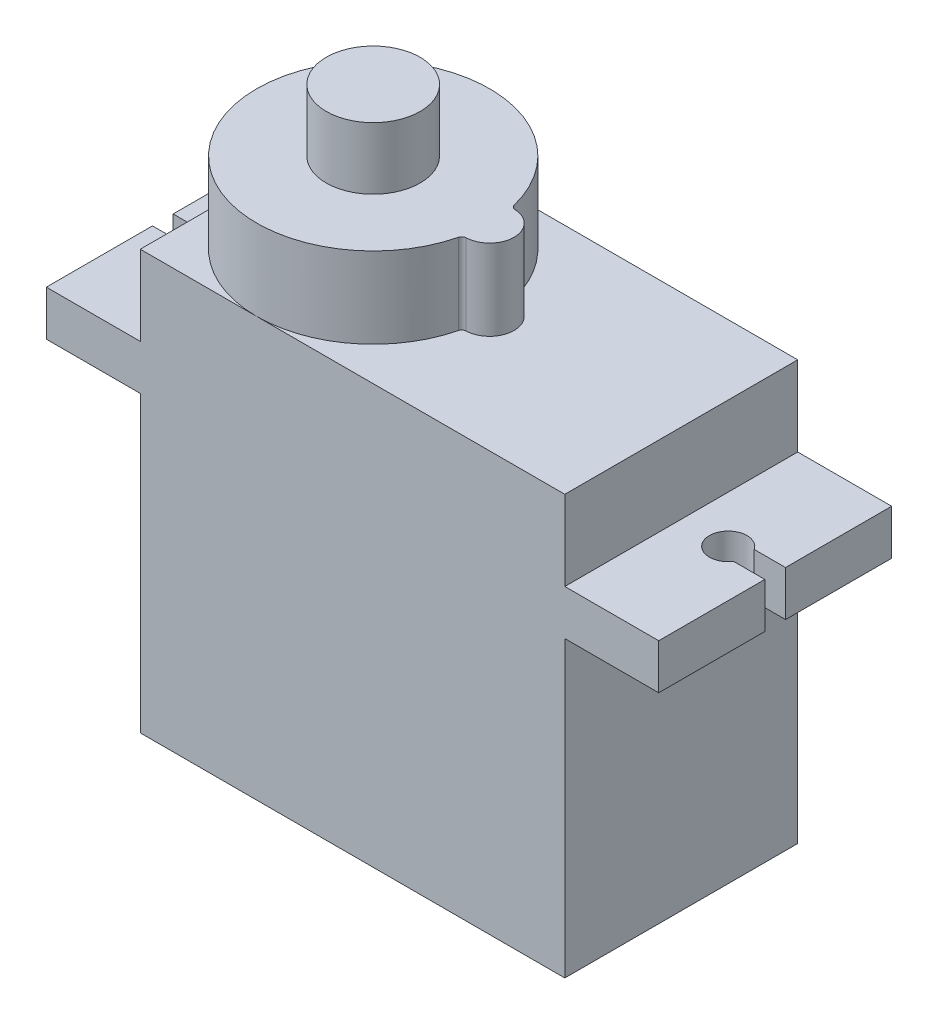
ISO-10303-21;
HEADER;
FILE_DESCRIPTION(('STEP AP214'),'2;1');
FILE_NAME('part.step','',(''),(''),'','','');
FILE_SCHEMA(('AUTOMOTIVE_DESIGN { 1 0 10303 214 1 1 1 1 }'));
ENDSEC;
DATA;
#1=APPLICATION_CONTEXT('core data for automotive mechanical design processes');
#2=APPLICATION_PROTOCOL_DEFINITION('international standard','automotive_design',2000,#1);
#3=PRODUCT_CONTEXT('',#1,'mechanical');
#4=PRODUCT('Part','Part','',(#3));
#5=PRODUCT_RELATED_PRODUCT_CATEGORY('part','',(#4));
#6=PRODUCT_DEFINITION_FORMATION('','',#4);
#7=PRODUCT_DEFINITION_CONTEXT('part definition',#1,'design');
#8=PRODUCT_DEFINITION('design','',#6,#7);
#9=PRODUCT_DEFINITION_SHAPE('','',#8);
#10=(LENGTH_UNIT() NAMED_UNIT(*) SI_UNIT(.MILLI.,.METRE.));
#11=(NAMED_UNIT(*) PLANE_ANGLE_UNIT() SI_UNIT($,.RADIAN.));
#12=(NAMED_UNIT(*) SI_UNIT($,.STERADIAN.) SOLID_ANGLE_UNIT());
#13=UNCERTAINTY_MEASURE_WITH_UNIT(LENGTH_MEASURE(1.E-05),#10,'distance_accuracy_value','');
#14=(GEOMETRIC_REPRESENTATION_CONTEXT(3) GLOBAL_UNCERTAINTY_ASSIGNED_CONTEXT((#13)) GLOBAL_UNIT_ASSIGNED_CONTEXT((#10,
#11,#12)) REPRESENTATION_CONTEXT('',''));
#15=CARTESIAN_POINT('',(0.,0.,0.));
#16=DIRECTION('',(0.,0.,1.));
#17=DIRECTION('',(1.,0.,0.));
#18=AXIS2_PLACEMENT_3D('',#15,#16,#17);
#19=CARTESIAN_POINT('',(-13600.,4499.23323880917,-1199.99975503217));
#20=DIRECTION('',(1.,0.,0.));
#21=DIRECTION('',(0.,0.,-1.));
#22=AXIS2_PLACEMENT_3D('',#19,#20,#21);
#23=CYLINDRICAL_SURFACE('',#22,600.);
#24=CARTESIAN_POINT('',(-13600.,4499.23323880917,-1199.99975503217));
#25=DIRECTION('',(-1.,0.,0.));
#26=DIRECTION('',(0.,0.,1.));
#27=AXIS2_PLACEMENT_3D('',#24,#25,#26);
#28=CIRCLE('',#27,600.);
#29=CARTESIAN_POINT('',(-13600.,4499.23323880917,-599.999755032172));
#30=VERTEX_POINT('',#29);
#31=EDGE_CURVE('E12',#30,#30,#28,.T.);
#32=ORIENTED_EDGE('',*,*,#31,.F.);
#33=EDGE_LOOP('',(#32));
#34=FACE_BOUND('',#33,.T.);
#35=CARTESIAN_POINT('',(-11300.,4499.23323880917,-1199.99975503217));
#36=DIRECTION('',(-1.,0.,0.));
#37=DIRECTION('',(0.,0.,1.));
#38=AXIS2_PLACEMENT_3D('',#35,#36,#37);
#39=CIRCLE('',#38,600.);
#40=CARTESIAN_POINT('',(-11300.,4499.23323880917,-599.999755032172));
#41=VERTEX_POINT('',#40);
#42=EDGE_CURVE('E63',#41,#41,#39,.T.);
#43=ORIENTED_EDGE('',*,*,#42,.T.);
#44=EDGE_LOOP('',(#43));
#45=FACE_BOUND('',#44,.T.);
#46=ADVANCED_FACE('F60',(#34,#45),#23,.T.);
#47=CARTESIAN_POINT('',(-13600.,0.,1.62193458052702E-12));
#48=DIRECTION('',(-1.,0.,0.));
#49=DIRECTION('',(0.,0.,1.));
#50=AXIS2_PLACEMENT_3D('',#47,#48,#49);
#51=PLANE('',#50);
#52=ORIENTED_EDGE('',*,*,#31,.T.);
#53=EDGE_LOOP('',(#52));
#54=FACE_BOUND('',#53,.T.);
#55=ADVANCED_FACE('F75',(#54),#51,.T.);
#56=CARTESIAN_POINT('',(-11300.,0.,1.29244903773504E-12));
#57=DIRECTION('',(-1.,0.,0.));
#58=DIRECTION('',(0.,0.,1.));
#59=AXIS2_PLACEMENT_3D('',#56,#57,#58);
#60=PLANE('',#59);
#61=ORIENTED_EDGE('',*,*,#42,.F.);
#62=EDGE_LOOP('',(#61));
#63=FACE_BOUND('',#62,.T.);
#64=ADVANCED_FACE('F73',(#63),#60,.F.);
#65=CLOSED_SHELL('',(#46,#55,#64));
#66=MANIFOLD_SOLID_BREP('B2',#65);
#67=CARTESIAN_POINT('',(-13600.,4500.,1.83417477069727E-12));
#68=DIRECTION('',(1.,0.,0.));
#69=DIRECTION('',(0.,0.,-1.));
#70=AXIS2_PLACEMENT_3D('',#67,#68,#69);
#71=CYLINDRICAL_SURFACE('',#70,600.);
#72=CARTESIAN_POINT('',(-13600.,4500.,1.83417477069727E-12));
#73=DIRECTION('',(-1.,0.,0.));
#74=DIRECTION('',(0.,0.,1.));
#75=AXIS2_PLACEMENT_3D('',#72,#73,#74);
#76=CIRCLE('',#75,600.);
#77=CARTESIAN_POINT('',(-13600.,4500.,600.000000000002));
#78=VERTEX_POINT('',#77);
#79=EDGE_CURVE('E59',#78,#78,#76,.T.);
#80=ORIENTED_EDGE('',*,*,#79,.F.);
#81=EDGE_LOOP('',(#80));
#82=FACE_BOUND('',#81,.T.);
#83=CARTESIAN_POINT('',(-11300.,4500.,1.50468922790529E-12));
#84=DIRECTION('',(-1.,0.,0.));
#85=DIRECTION('',(0.,0.,1.));
#86=AXIS2_PLACEMENT_3D('',#83,#84,#85);
#87=CIRCLE('',#86,600.);
#88=CARTESIAN_POINT('',(-11300.,4500.,600.000000000002));
#89=VERTEX_POINT('',#88);
#90=EDGE_CURVE('E116',#89,#89,#87,.T.);
#91=ORIENTED_EDGE('',*,*,#90,.T.);
#92=EDGE_LOOP('',(#91));
#93=FACE_BOUND('',#92,.T.);
#94=ADVANCED_FACE('F113',(#82,#93),#71,.T.);
#95=CARTESIAN_POINT('',(-13600.,0.,1.62193458052702E-12));
#96=DIRECTION('',(-1.,0.,0.));
#97=DIRECTION('',(0.,0.,1.));
#98=AXIS2_PLACEMENT_3D('',#95,#96,#97);
#99=PLANE('',#98);
#100=ORIENTED_EDGE('',*,*,#79,.T.);
#101=EDGE_LOOP('',(#100));
#102=FACE_BOUND('',#101,.T.);
#103=ADVANCED_FACE('F128',(#102),#99,.T.);
#104=CARTESIAN_POINT('',(-11300.,0.,1.29244903773504E-12));
#105=DIRECTION('',(-1.,0.,0.));
#106=DIRECTION('',(0.,0.,1.));
#107=AXIS2_PLACEMENT_3D('',#104,#105,#106);
#108=PLANE('',#107);
#109=ORIENTED_EDGE('',*,*,#90,.F.);
#110=EDGE_LOOP('',(#109));
#111=FACE_BOUND('',#110,.T.);
#112=ADVANCED_FACE('F126',(#111),#108,.F.);
#113=CLOSED_SHELL('',(#94,#103,#112));
#114=MANIFOLD_SOLID_BREP('B7',#113);
#115=CARTESIAN_POINT('',(-13600.,4499.23960373797,1199.99975908228));
#116=DIRECTION('',(1.,0.,0.));
#117=DIRECTION('',(0.,0.,-1.));
#118=AXIS2_PLACEMENT_3D('',#115,#116,#117);
#119=CYLINDRICAL_SURFACE('',#118,600.);
#120=CARTESIAN_POINT('',(-13600.,4499.23960373797,1199.99975908228));
#121=DIRECTION('',(-1.,0.,0.));
#122=DIRECTION('',(0.,0.,1.));
#123=AXIS2_PLACEMENT_3D('',#120,#121,#122);
#124=CIRCLE('',#123,600.);
#125=CARTESIAN_POINT('',(-13600.,4499.23960373797,1799.99975908228));
#126=VERTEX_POINT('',#125);
#127=EDGE_CURVE('E112',#126,#126,#124,.T.);
#128=ORIENTED_EDGE('',*,*,#127,.F.);
#129=EDGE_LOOP('',(#128));
#130=FACE_BOUND('',#129,.T.);
#131=CARTESIAN_POINT('',(-11300.,4499.23960373797,1199.99975908228));
#132=DIRECTION('',(-1.,0.,0.));
#133=DIRECTION('',(0.,0.,1.));
#134=AXIS2_PLACEMENT_3D('',#131,#132,#133);
#135=CIRCLE('',#134,600.);
#136=CARTESIAN_POINT('',(-11300.,4499.23960373797,1799.99975908228));
#137=VERTEX_POINT('',#136);
#138=EDGE_CURVE('E170',#137,#137,#135,.T.);
#139=ORIENTED_EDGE('',*,*,#138,.T.);
#140=EDGE_LOOP('',(#139));
#141=FACE_BOUND('',#140,.T.);
#142=ADVANCED_FACE('F167',(#130,#141),#119,.T.);
#143=CARTESIAN_POINT('',(-13600.,0.,1.62193458052702E-12));
#144=DIRECTION('',(-1.,0.,0.));
#145=DIRECTION('',(0.,0.,1.));
#146=AXIS2_PLACEMENT_3D('',#143,#144,#145);
#147=PLANE('',#146);
#148=ORIENTED_EDGE('',*,*,#127,.T.);
#149=EDGE_LOOP('',(#148));
#150=FACE_BOUND('',#149,.T.);
#151=ADVANCED_FACE('F182',(#150),#147,.T.);
#152=CARTESIAN_POINT('',(-11300.,0.,1.29244903773504E-12));
#153=DIRECTION('',(-1.,0.,0.));
#154=DIRECTION('',(0.,0.,1.));
#155=AXIS2_PLACEMENT_3D('',#152,#153,#154);
#156=PLANE('',#155);
#157=ORIENTED_EDGE('',*,*,#138,.F.);
#158=EDGE_LOOP('',(#157));
#159=FACE_BOUND('',#158,.T.);
#160=ADVANCED_FACE('F180',(#159),#156,.F.);
#161=CLOSED_SHELL('',(#142,#151,#160));
#162=MANIFOLD_SOLID_BREP('B54',#161);
#163=CARTESIAN_POINT('',(0.,22300.,0.));
#164=DIRECTION('',(0.,1.,0.));
#165=DIRECTION('',(0.,0.,1.));
#166=AXIS2_PLACEMENT_3D('',#163,#164,#165);
#167=PLANE('',#166);
#168=CARTESIAN_POINT('',(-5100.,22300.,0.));
#169=DIRECTION('',(0.,1.,0.));
#170=DIRECTION('',(0.,0.,1.));
#171=AXIS2_PLACEMENT_3D('',#168,#169,#170);
#172=CIRCLE('',#171,6200.);
#173=CARTESIAN_POINT('',(-5100.,22300.,-6200.));
#174=VERTEX_POINT('',#173);
#175=CARTESIAN_POINT('',(-11300.,22300.,8.88178419700125E-13));
#176=VERTEX_POINT('',#175);
#177=EDGE_CURVE('E165',#174,#176,#172,.T.);
#178=ORIENTED_EDGE('',*,*,#177,.F.);
#179=DIRECTION('',(-1.,0.,0.));
#180=VECTOR('',#179,1.);
#181=CARTESIAN_POINT('',(-11300.,22300.,-6200.));
#182=LINE('',#181,#180);
#183=CARTESIAN_POINT('',(-11300.,22300.,-6200.));
#184=VERTEX_POINT('',#183);
#185=EDGE_CURVE('E517',#174,#184,#182,.T.);
#186=ORIENTED_EDGE('',*,*,#185,.T.);
#187=DIRECTION('',(0.,0.,1.));
#188=VECTOR('',#187,1.);
#189=CARTESIAN_POINT('',(-11300.,22300.,-6200.));
#190=LINE('',#189,#188);
#191=EDGE_CURVE('E522',#184,#176,#190,.T.);
#192=ORIENTED_EDGE('',*,*,#191,.T.);
#193=EDGE_LOOP('',(#178,#186,#192));
#194=FACE_BOUND('',#193,.T.);
#195=ADVANCED_FACE('F208',(#194),#167,.T.);
#196=CARTESIAN_POINT('',(-5100.,22300.,6200.));
#197=VERTEX_POINT('',#196);
#198=EDGE_CURVE('E217',#176,#197,#172,.T.);
#199=ORIENTED_EDGE('',*,*,#198,.F.);
#200=CARTESIAN_POINT('',(-11300.,22300.,6200.));
#201=VERTEX_POINT('',#200);
#202=EDGE_CURVE('E521',#176,#201,#190,.T.);
#203=ORIENTED_EDGE('',*,*,#202,.T.);
#204=DIRECTION('',(1.,0.,0.));
#205=VECTOR('',#204,1.);
#206=CARTESIAN_POINT('',(-11300.,22300.,6200.));
#207=LINE('',#206,#205);
#208=EDGE_CURVE('E526',#201,#197,#207,.T.);
#209=ORIENTED_EDGE('',*,*,#208,.T.);
#210=EDGE_LOOP('',(#199,#203,#209));
#211=FACE_BOUND('',#210,.T.);
#212=ADVANCED_FACE('F593',(#211),#167,.T.);
#213=CARTESIAN_POINT('',(16300.,18050.,-6200.));
#214=DIRECTION('',(1.,0.,0.));
#215=DIRECTION('',(0.,0.,-1.));
#216=AXIS2_PLACEMENT_3D('',#213,#214,#215);
#217=PLANE('',#216);
#218=DIRECTION('',(0.,1.,0.));
#219=VECTOR('',#218,1.);
#220=CARTESIAN_POINT('',(16300.,-4250.,-550.));
#221=LINE('',#220,#219);
#222=CARTESIAN_POINT('',(16300.,15650.,-550.));
#223=VERTEX_POINT('',#222);
#224=CARTESIAN_POINT('',(16300.,18050.,-550.));
#225=VERTEX_POINT('',#224);
#226=EDGE_CURVE('E435',#223,#225,#221,.T.);
#227=ORIENTED_EDGE('',*,*,#226,.F.);
#228=DIRECTION('',(0.,0.,1.));
#229=VECTOR('',#228,1.);
#230=CARTESIAN_POINT('',(16300.,15650.,-6200.));
#231=LINE('',#230,#229);
#232=CARTESIAN_POINT('',(16300.,15650.,-6200.));
#233=VERTEX_POINT('',#232);
#234=EDGE_CURVE('E501',#233,#223,#231,.T.);
#235=ORIENTED_EDGE('',*,*,#234,.F.);
#236=DIRECTION('',(0.,1.,0.));
#237=VECTOR('',#236,1.);
#238=CARTESIAN_POINT('',(16300.,18050.,-6200.));
#239=LINE('',#238,#237);
#240=CARTESIAN_POINT('',(16300.,18050.,-6200.));
#241=VERTEX_POINT('',#240);
#242=EDGE_CURVE('E484',#233,#241,#239,.T.);
#243=ORIENTED_EDGE('',*,*,#242,.T.);
#244=DIRECTION('',(0.,0.,1.));
#245=VECTOR('',#244,1.);
#246=CARTESIAN_POINT('',(16300.,18050.,-6200.));
#247=LINE('',#246,#245);
#248=EDGE_CURVE('E511',#241,#225,#247,.T.);
#249=ORIENTED_EDGE('',*,*,#248,.T.);
#250=EDGE_LOOP('',(#227,#235,#243,#249));
#251=FACE_BOUND('',#250,.T.);
#252=ADVANCED_FACE('F639',(#251),#217,.T.);
#253=CARTESIAN_POINT('',(-16300.,18050.,-6200.));
#254=DIRECTION('',(-1.,0.,0.));
#255=DIRECTION('',(0.,0.,1.));
#256=AXIS2_PLACEMENT_3D('',#253,#254,#255);
#257=PLANE('',#256);
#258=DIRECTION('',(0.,1.,0.));
#259=VECTOR('',#258,1.);
#260=CARTESIAN_POINT('',(-16300.,-4250.,-550.));
#261=LINE('',#260,#259);
#262=CARTESIAN_POINT('',(-16300.,15650.,-550.));
#263=VERTEX_POINT('',#262);
#264=CARTESIAN_POINT('',(-16300.,18050.,-550.));
#265=VERTEX_POINT('',#264);
#266=EDGE_CURVE('E419',#263,#265,#261,.T.);
#267=ORIENTED_EDGE('',*,*,#266,.T.);
#268=DIRECTION('',(0.,0.,1.));
#269=VECTOR('',#268,1.);
#270=CARTESIAN_POINT('',(-16300.,18050.,-6200.));
#271=LINE('',#270,#269);
#272=CARTESIAN_POINT('',(-16300.,18050.,-6200.));
#273=VERTEX_POINT('',#272);
#274=EDGE_CURVE('E478',#273,#265,#271,.T.);
#275=ORIENTED_EDGE('',*,*,#274,.F.);
#276=DIRECTION('',(0.,-1.,0.));
#277=VECTOR('',#276,1.);
#278=CARTESIAN_POINT('',(-16300.,18050.,-6200.));
#279=LINE('',#278,#277);
#280=CARTESIAN_POINT('',(-16300.,15650.,-6200.));
#281=VERTEX_POINT('',#280);
#282=EDGE_CURVE('E457',#273,#281,#279,.T.);
#283=ORIENTED_EDGE('',*,*,#282,.T.);
#284=DIRECTION('',(0.,0.,1.));
#285=VECTOR('',#284,1.);
#286=CARTESIAN_POINT('',(-16300.,15650.,-6200.));
#287=LINE('',#286,#285);
#288=EDGE_CURVE('E474',#281,#263,#287,.T.);
#289=ORIENTED_EDGE('',*,*,#288,.T.);
#290=EDGE_LOOP('',(#267,#275,#283,#289));
#291=FACE_BOUND('',#290,.T.);
#292=ADVANCED_FACE('F675',(#291),#257,.T.);
#293=CARTESIAN_POINT('',(-11300.,22300.,-6200.));
#294=DIRECTION('',(1.,0.,0.));
#295=DIRECTION('',(0.,0.,-1.));
#296=AXIS2_PLACEMENT_3D('',#293,#294,#295);
#297=PLANE('',#296);
#298=DIRECTION('',(0.,0.,1.));
#299=VECTOR('',#298,1.);
#300=CARTESIAN_POINT('',(-11300.,15650.,-6200.));
#301=LINE('',#300,#299);
#302=CARTESIAN_POINT('',(-11300.,15650.,-6200.));
#303=VERTEX_POINT('',#302);
#304=CARTESIAN_POINT('',(-11300.,15650.,6200.));
#305=VERTEX_POINT('',#304);
#306=EDGE_CURVE('E471',#303,#305,#301,.T.);
#307=ORIENTED_EDGE('',*,*,#306,.F.);
#308=DIRECTION('',(0.,-1.,0.));
#309=VECTOR('',#308,1.);
#310=CARTESIAN_POINT('',(-11300.,22300.,-6200.));
#311=LINE('',#310,#309);
#312=CARTESIAN_POINT('',(-11300.,0.,-6200.));
#313=VERTEX_POINT('',#312);
#314=EDGE_CURVE('E546',#303,#313,#311,.T.);
#315=ORIENTED_EDGE('',*,*,#314,.T.);
#316=DIRECTION('',(0.,0.,1.));
#317=VECTOR('',#316,1.);
#318=CARTESIAN_POINT('',(-11300.,0.,-6200.));
#319=LINE('',#318,#317);
#320=CARTESIAN_POINT('',(-11300.,0.,6200.));
#321=VERTEX_POINT('',#320);
#322=EDGE_CURVE('E535',#313,#321,#319,.T.);
#323=ORIENTED_EDGE('',*,*,#322,.T.);
#324=DIRECTION('',(0.,-1.,0.));
#325=VECTOR('',#324,1.);
#326=CARTESIAN_POINT('',(-11300.,22300.,6200.));
#327=LINE('',#326,#325);
#328=EDGE_CURVE('E543',#305,#321,#327,.T.);
#329=ORIENTED_EDGE('',*,*,#328,.F.);
#330=EDGE_LOOP('',(#307,#315,#323,#329));
#331=FACE_BOUND('',#330,.T.);
#332=ADVANCED_FACE('F556',(#331),#297,.F.);
#333=CARTESIAN_POINT('',(11300.,22300.,-6200.));
#334=DIRECTION('',(-1.,0.,0.));
#335=DIRECTION('',(0.,0.,1.));
#336=AXIS2_PLACEMENT_3D('',#333,#334,#335);
#337=PLANE('',#336);
#338=DIRECTION('',(0.,0.,1.));
#339=VECTOR('',#338,1.);
#340=CARTESIAN_POINT('',(11300.,18050.,-6200.));
#341=LINE('',#340,#339);
#342=CARTESIAN_POINT('',(11300.,18050.,-6200.));
#343=VERTEX_POINT('',#342);
#344=CARTESIAN_POINT('',(11300.,18050.,6200.));
#345=VERTEX_POINT('',#344);
#346=EDGE_CURVE('E509',#343,#345,#341,.T.);
#347=ORIENTED_EDGE('',*,*,#346,.F.);
#348=DIRECTION('',(0.,-1.,0.));
#349=VECTOR('',#348,1.);
#350=CARTESIAN_POINT('',(11300.,22300.,-6200.));
#351=LINE('',#350,#349);
#352=CARTESIAN_POINT('',(11300.,22300.,-6200.));
#353=VERTEX_POINT('',#352);
#354=EDGE_CURVE('E212',#353,#343,#351,.T.);
#355=ORIENTED_EDGE('',*,*,#354,.F.);
#356=DIRECTION('',(0.,0.,-1.));
#357=VECTOR('',#356,1.);
#358=CARTESIAN_POINT('',(11300.,22300.,-6200.));
#359=LINE('',#358,#357);
#360=CARTESIAN_POINT('',(11300.,22300.,6200.));
#361=VERTEX_POINT('',#360);
#362=EDGE_CURVE('E514',#361,#353,#359,.T.);
#363=ORIENTED_EDGE('',*,*,#362,.F.);
#364=DIRECTION('',(0.,-1.,0.));
#365=VECTOR('',#364,1.);
#366=CARTESIAN_POINT('',(11300.,22300.,6200.));
#367=LINE('',#366,#365);
#368=EDGE_CURVE('E540',#361,#345,#367,.T.);
#369=ORIENTED_EDGE('',*,*,#368,.T.);
#370=EDGE_LOOP('',(#347,#355,#363,#369));
#371=FACE_BOUND('',#370,.T.);
#372=ADVANCED_FACE('F654',(#371),#337,.F.);
#373=CARTESIAN_POINT('',(11300.,15650.,-6200.));
#374=VERTEX_POINT('',#373);
#375=CARTESIAN_POINT('',(11300.,0.,-6200.));
#376=VERTEX_POINT('',#375);
#377=EDGE_CURVE('E549',#374,#376,#351,.T.);
#378=ORIENTED_EDGE('',*,*,#377,.F.);
#379=DIRECTION('',(0.,0.,1.));
#380=VECTOR('',#379,1.);
#381=CARTESIAN_POINT('',(11300.,15650.,-6200.));
#382=LINE('',#381,#380);
#383=CARTESIAN_POINT('',(11300.,15650.,6200.));
#384=VERTEX_POINT('',#383);
#385=EDGE_CURVE('E506',#374,#384,#382,.T.);
#386=ORIENTED_EDGE('',*,*,#385,.T.);
#387=CARTESIAN_POINT('',(11300.,0.,6200.));
#388=VERTEX_POINT('',#387);
#389=EDGE_CURVE('E529',#384,#388,#367,.T.);
#390=ORIENTED_EDGE('',*,*,#389,.T.);
#391=DIRECTION('',(0.,0.,-1.));
#392=VECTOR('',#391,1.);
#393=CARTESIAN_POINT('',(11300.,0.,-6200.));
#394=LINE('',#393,#392);
#395=EDGE_CURVE('E504',#388,#376,#394,.T.);
#396=ORIENTED_EDGE('',*,*,#395,.T.);
#397=EDGE_LOOP('',(#378,#386,#390,#396));
#398=FACE_BOUND('',#397,.T.);
#399=ADVANCED_FACE('F210',(#398),#337,.F.);
#400=CARTESIAN_POINT('',(-11300.,22300.,-6200.));
#401=DIRECTION('',(0.,0.,1.));
#402=DIRECTION('',(1.,0.,0.));
#403=AXIS2_PLACEMENT_3D('',#400,#401,#402);
#404=PLANE('',#403);
#405=DIRECTION('',(-1.,0.,0.));
#406=VECTOR('',#405,1.);
#407=CARTESIAN_POINT('',(-11300.,0.,-6200.));
#408=LINE('',#407,#406);
#409=EDGE_CURVE('E532',#376,#313,#408,.T.);
#410=ORIENTED_EDGE('',*,*,#409,.T.);
#411=ORIENTED_EDGE('',*,*,#314,.F.);
#412=DIRECTION('',(1.,0.,0.));
#413=VECTOR('',#412,1.);
#414=CARTESIAN_POINT('',(-11300.,15650.,-6200.));
#415=LINE('',#414,#413);
#416=EDGE_CURVE('E461',#281,#303,#415,.T.);
#417=ORIENTED_EDGE('',*,*,#416,.F.);
#418=ORIENTED_EDGE('',*,*,#282,.F.);
#419=DIRECTION('',(-1.,0.,0.));
#420=VECTOR('',#419,1.);
#421=CARTESIAN_POINT('',(-11300.,18050.,-6200.));
#422=LINE('',#421,#420);
#423=CARTESIAN_POINT('',(-11300.,18050.,-6200.));
#424=VERTEX_POINT('',#423);
#425=EDGE_CURVE('E454',#424,#273,#422,.T.);
#426=ORIENTED_EDGE('',*,*,#425,.F.);
#427=EDGE_CURVE('E547',#184,#424,#311,.T.);
#428=ORIENTED_EDGE('',*,*,#427,.F.);
#429=ORIENTED_EDGE('',*,*,#185,.F.);
#430=EDGE_CURVE('E519',#353,#174,#182,.T.);
#431=ORIENTED_EDGE('',*,*,#430,.F.);
#432=ORIENTED_EDGE('',*,*,#354,.T.);
#433=DIRECTION('',(-1.,0.,0.));
#434=VECTOR('',#433,1.);
#435=CARTESIAN_POINT('',(11300.,18050.,-6200.));
#436=LINE('',#435,#434);
#437=EDGE_CURVE('E487',#241,#343,#436,.T.);
#438=ORIENTED_EDGE('',*,*,#437,.F.);
#439=ORIENTED_EDGE('',*,*,#242,.F.);
#440=DIRECTION('',(1.,0.,0.));
#441=VECTOR('',#440,1.);
#442=CARTESIAN_POINT('',(11300.,15650.,-6200.));
#443=LINE('',#442,#441);
#444=EDGE_CURVE('E490',#374,#233,#443,.T.);
#445=ORIENTED_EDGE('',*,*,#444,.F.);
#446=ORIENTED_EDGE('',*,*,#377,.T.);
#447=EDGE_LOOP('',(#410,#411,#417,#418,#426,#428,#429,#431,#432,#438,#439,#445,#446));
#448=FACE_BOUND('',#447,.T.);
#449=ADVANCED_FACE('F563',(#448),#404,.F.);
#450=ORIENTED_EDGE('',*,*,#427,.T.);
#451=DIRECTION('',(0.,0.,1.));
#452=VECTOR('',#451,1.);
#453=CARTESIAN_POINT('',(-11300.,18050.,-6200.));
#454=LINE('',#453,#452);
#455=CARTESIAN_POINT('',(-11300.,18050.,6200.));
#456=VERTEX_POINT('',#455);
#457=EDGE_CURVE('E463',#424,#456,#454,.T.);
#458=ORIENTED_EDGE('',*,*,#457,.T.);
#459=EDGE_CURVE('E544',#201,#456,#327,.T.);
#460=ORIENTED_EDGE('',*,*,#459,.F.);
#461=ORIENTED_EDGE('',*,*,#202,.F.);
#462=ORIENTED_EDGE('',*,*,#191,.F.);
#463=EDGE_LOOP('',(#450,#458,#460,#461,#462));
#464=FACE_BOUND('',#463,.T.);
#465=ADVANCED_FACE('F586',(#464),#297,.F.);
#466=CARTESIAN_POINT('',(-11300.,22300.,6200.));
#467=DIRECTION('',(0.,0.,-1.));
#468=DIRECTION('',(-1.,0.,0.));
#469=AXIS2_PLACEMENT_3D('',#466,#467,#468);
#470=PLANE('',#469);
#471=DIRECTION('',(1.,0.,0.));
#472=VECTOR('',#471,1.);
#473=CARTESIAN_POINT('',(-11300.,0.,6200.));
#474=LINE('',#473,#472);
#475=EDGE_CURVE('E518',#321,#388,#474,.T.);
#476=ORIENTED_EDGE('',*,*,#475,.T.);
#477=ORIENTED_EDGE('',*,*,#389,.F.);
#478=DIRECTION('',(1.,0.,0.));
#479=VECTOR('',#478,1.);
#480=CARTESIAN_POINT('',(11300.,15650.,6200.));
#481=LINE('',#480,#479);
#482=CARTESIAN_POINT('',(16300.,15650.,6200.));
#483=VERTEX_POINT('',#482);
#484=EDGE_CURVE('E488',#384,#483,#481,.T.);
#485=ORIENTED_EDGE('',*,*,#484,.T.);
#486=DIRECTION('',(0.,1.,0.));
#487=VECTOR('',#486,1.);
#488=CARTESIAN_POINT('',(16300.,18050.,6200.));
#489=LINE('',#488,#487);
#490=CARTESIAN_POINT('',(16300.,18050.,6200.));
#491=VERTEX_POINT('',#490);
#492=EDGE_CURVE('E473',#483,#491,#489,.T.);
#493=ORIENTED_EDGE('',*,*,#492,.T.);
#494=DIRECTION('',(-1.,0.,0.));
#495=VECTOR('',#494,1.);
#496=CARTESIAN_POINT('',(11300.,18050.,6200.));
#497=LINE('',#496,#495);
#498=EDGE_CURVE('E496',#491,#345,#497,.T.);
#499=ORIENTED_EDGE('',*,*,#498,.T.);
#500=ORIENTED_EDGE('',*,*,#368,.F.);
#501=EDGE_CURVE('E525',#197,#361,#207,.T.);
#502=ORIENTED_EDGE('',*,*,#501,.F.);
#503=ORIENTED_EDGE('',*,*,#208,.F.);
#504=ORIENTED_EDGE('',*,*,#459,.T.);
#505=DIRECTION('',(-1.,0.,0.));
#506=VECTOR('',#505,1.);
#507=CARTESIAN_POINT('',(-11300.,18050.,6200.));
#508=LINE('',#507,#506);
#509=CARTESIAN_POINT('',(-16300.,18050.,6200.));
#510=VERTEX_POINT('',#509);
#511=EDGE_CURVE('E453',#456,#510,#508,.T.);
#512=ORIENTED_EDGE('',*,*,#511,.T.);
#513=DIRECTION('',(0.,-1.,0.));
#514=VECTOR('',#513,1.);
#515=CARTESIAN_POINT('',(-16300.,18050.,6200.));
#516=LINE('',#515,#514);
#517=CARTESIAN_POINT('',(-16300.,15650.,6200.));
#518=VERTEX_POINT('',#517);
#519=EDGE_CURVE('E466',#510,#518,#516,.T.);
#520=ORIENTED_EDGE('',*,*,#519,.T.);
#521=DIRECTION('',(1.,0.,0.));
#522=VECTOR('',#521,1.);
#523=CARTESIAN_POINT('',(-11300.,15650.,6200.));
#524=LINE('',#523,#522);
#525=EDGE_CURVE('E458',#518,#305,#524,.T.);
#526=ORIENTED_EDGE('',*,*,#525,.T.);
#527=ORIENTED_EDGE('',*,*,#328,.T.);
#528=EDGE_LOOP('',(#476,#477,#485,#493,#499,#500,#502,#503,#504,#512,#520,#526,#527));
#529=FACE_BOUND('',#528,.T.);
#530=ADVANCED_FACE('F571',(#529),#470,.F.);
#531=CARTESIAN_POINT('',(918.604651162784,22300.,1488.75721761529));
#532=VERTEX_POINT('',#531);
#533=EDGE_CURVE('E596',#197,#532,#172,.T.);
#534=ORIENTED_EDGE('',*,*,#533,.F.);
#535=ORIENTED_EDGE('',*,*,#501,.T.);
#536=ORIENTED_EDGE('',*,*,#362,.T.);
#537=ORIENTED_EDGE('',*,*,#430,.T.);
#538=CARTESIAN_POINT('',(918.604651162785,22300.,-1488.75721761529));
#539=VERTEX_POINT('',#538);
#540=EDGE_CURVE('E219',#539,#174,#172,.T.);
#541=ORIENTED_EDGE('',*,*,#540,.F.);
#542=CARTESIAN_POINT('',(1161.29032258064,22300.,-1548.78775058365));
#543=DIRECTION('',(0.,-1.,0.));
#544=DIRECTION('',(0.,0.,-1.));
#545=AXIS2_PLACEMENT_3D('',#542,#543,#544);
#546=CIRCLE('',#545,250.);
#547=CARTESIAN_POINT('',(1151.40478668054,22300.,-1298.98327468306));
#548=VERTEX_POINT('',#547);
#549=EDGE_CURVE('E599',#548,#539,#546,.T.);
#550=ORIENTED_EDGE('',*,*,#549,.F.);
#551=CARTESIAN_POINT('',(1100.,22300.,0.));
#552=DIRECTION('',(0.,1.,0.));
#553=DIRECTION('',(0.,0.,1.));
#554=AXIS2_PLACEMENT_3D('',#551,#552,#553);
#555=CIRCLE('',#554,1300.);
#556=CARTESIAN_POINT('',(1151.40478668054,22300.,1298.98327468306));
#557=VERTEX_POINT('',#556);
#558=EDGE_CURVE('E606',#557,#548,#555,.T.);
#559=ORIENTED_EDGE('',*,*,#558,.F.);
#560=CARTESIAN_POINT('',(1161.29032258064,22300.,1548.78775058365));
#561=DIRECTION('',(0.,-1.,0.));
#562=DIRECTION('',(0.,0.,1.));
#563=AXIS2_PLACEMENT_3D('',#560,#561,#562);
#564=CIRCLE('',#563,250.);
#565=EDGE_CURVE('E226',#532,#557,#564,.T.);
#566=ORIENTED_EDGE('',*,*,#565,.F.);
#567=EDGE_LOOP('',(#534,#535,#536,#537,#541,#550,#559,#566));
#568=FACE_BOUND('',#567,.T.);
#569=ADVANCED_FACE('F635',(#568),#167,.T.);
#570=CARTESIAN_POINT('',(0.,0.,0.));
#571=DIRECTION('',(0.,1.,0.));
#572=DIRECTION('',(0.,0.,1.));
#573=AXIS2_PLACEMENT_3D('',#570,#571,#572);
#574=PLANE('',#573);
#575=ORIENTED_EDGE('',*,*,#395,.F.);
#576=ORIENTED_EDGE('',*,*,#475,.F.);
#577=ORIENTED_EDGE('',*,*,#322,.F.);
#578=ORIENTED_EDGE('',*,*,#409,.F.);
#579=EDGE_LOOP('',(#575,#576,#577,#578));
#580=FACE_BOUND('',#579,.T.);
#581=ADVANCED_FACE('F568',(#580),#574,.F.);
#582=DIRECTION('',(0.,1.,0.));
#583=VECTOR('',#582,1.);
#584=CARTESIAN_POINT('',(16300.,-4250.,550.));
#585=LINE('',#584,#583);
#586=CARTESIAN_POINT('',(16300.,15650.,550.));
#587=VERTEX_POINT('',#586);
#588=CARTESIAN_POINT('',(16300.,18050.,550.));
#589=VERTEX_POINT('',#588);
#590=EDGE_CURVE('E437',#587,#589,#585,.T.);
#591=ORIENTED_EDGE('',*,*,#590,.T.);
#592=EDGE_CURVE('E493',#589,#491,#247,.T.);
#593=ORIENTED_EDGE('',*,*,#592,.T.);
#594=ORIENTED_EDGE('',*,*,#492,.F.);
#595=EDGE_CURVE('E505',#587,#483,#231,.T.);
#596=ORIENTED_EDGE('',*,*,#595,.F.);
#597=EDGE_LOOP('',(#591,#593,#594,#596));
#598=FACE_BOUND('',#597,.T.);
#599=ADVANCED_FACE('F647',(#598),#217,.T.);
#600=CARTESIAN_POINT('',(11300.,15650.,-6200.));
#601=DIRECTION('',(0.,-1.,0.));
#602=DIRECTION('',(0.,0.,-1.));
#603=AXIS2_PLACEMENT_3D('',#600,#601,#602);
#604=PLANE('',#603);
#605=DIRECTION('',(1.,0.,0.));
#606=VECTOR('',#605,1.);
#607=CARTESIAN_POINT('',(11300.,15650.,-549.999999999999));
#608=LINE('',#607,#606);
#609=CARTESIAN_POINT('',(14635.1646544245,15650.,-550.));
#610=VERTEX_POINT('',#609);
#611=EDGE_CURVE('E449',#610,#223,#608,.T.);
#612=ORIENTED_EDGE('',*,*,#611,.F.);
#613=CARTESIAN_POINT('',(13800.,15650.,0.));
#614=DIRECTION('',(0.,-1.,0.));
#615=DIRECTION('',(0.,0.,-1.));
#616=AXIS2_PLACEMENT_3D('',#613,#614,#615);
#617=CIRCLE('',#616,1000.);
#618=CARTESIAN_POINT('',(14635.1646544245,15650.,550.));
#619=VERTEX_POINT('',#618);
#620=EDGE_CURVE('E451',#619,#610,#617,.T.);
#621=ORIENTED_EDGE('',*,*,#620,.F.);
#622=DIRECTION('',(-1.,0.,0.));
#623=VECTOR('',#622,1.);
#624=CARTESIAN_POINT('',(11300.,15650.,550.));
#625=LINE('',#624,#623);
#626=EDGE_CURVE('E447',#587,#619,#625,.T.);
#627=ORIENTED_EDGE('',*,*,#626,.F.);
#628=ORIENTED_EDGE('',*,*,#595,.T.);
#629=ORIENTED_EDGE('',*,*,#484,.F.);
#630=ORIENTED_EDGE('',*,*,#385,.F.);
#631=ORIENTED_EDGE('',*,*,#444,.T.);
#632=ORIENTED_EDGE('',*,*,#234,.T.);
#633=EDGE_LOOP('',(#612,#621,#627,#628,#629,#630,#631,#632));
#634=FACE_BOUND('',#633,.T.);
#635=ADVANCED_FACE('F664',(#634),#604,.T.);
#636=CARTESIAN_POINT('',(11300.,18050.,-6200.));
#637=DIRECTION('',(0.,1.,0.));
#638=DIRECTION('',(0.,0.,1.));
#639=AXIS2_PLACEMENT_3D('',#636,#637,#638);
#640=PLANE('',#639);
#641=DIRECTION('',(-1.,0.,0.));
#642=VECTOR('',#641,1.);
#643=CARTESIAN_POINT('',(14635.1646544245,18050.,-550.));
#644=LINE('',#643,#642);
#645=CARTESIAN_POINT('',(14635.1646544245,18050.,-550.));
#646=VERTEX_POINT('',#645);
#647=EDGE_CURVE('E430',#225,#646,#644,.T.);
#648=ORIENTED_EDGE('',*,*,#647,.F.);
#649=ORIENTED_EDGE('',*,*,#248,.F.);
#650=ORIENTED_EDGE('',*,*,#437,.T.);
#651=ORIENTED_EDGE('',*,*,#346,.T.);
#652=ORIENTED_EDGE('',*,*,#498,.F.);
#653=ORIENTED_EDGE('',*,*,#592,.F.);
#654=DIRECTION('',(1.,0.,0.));
#655=VECTOR('',#654,1.);
#656=CARTESIAN_POINT('',(14635.1646544245,18050.,550.));
#657=LINE('',#656,#655);
#658=CARTESIAN_POINT('',(14635.1646544245,18050.,550.));
#659=VERTEX_POINT('',#658);
#660=EDGE_CURVE('E404',#659,#589,#657,.T.);
#661=ORIENTED_EDGE('',*,*,#660,.F.);
#662=CARTESIAN_POINT('',(13800.,18050.,0.));
#663=DIRECTION('',(0.,1.,0.));
#664=DIRECTION('',(0.,0.,1.));
#665=AXIS2_PLACEMENT_3D('',#662,#663,#664);
#666=CIRCLE('',#665,1000.);
#667=EDGE_CURVE('E402',#646,#659,#666,.T.);
#668=ORIENTED_EDGE('',*,*,#667,.F.);
#669=EDGE_LOOP('',(#648,#649,#650,#651,#652,#653,#661,#668));
#670=FACE_BOUND('',#669,.T.);
#671=ADVANCED_FACE('F778',(#670),#640,.T.);
#672=CARTESIAN_POINT('',(-11300.,15650.,-6200.));
#673=DIRECTION('',(0.,-1.,0.));
#674=DIRECTION('',(0.,0.,-1.));
#675=AXIS2_PLACEMENT_3D('',#672,#673,#674);
#676=PLANE('',#675);
#677=DIRECTION('',(1.,0.,0.));
#678=VECTOR('',#677,1.);
#679=CARTESIAN_POINT('',(-11300.,15650.,-549.999999999999));
#680=LINE('',#679,#678);
#681=CARTESIAN_POINT('',(-14635.1646544245,15650.,-550.));
#682=VERTEX_POINT('',#681);
#683=EDGE_CURVE('E445',#263,#682,#680,.T.);
#684=ORIENTED_EDGE('',*,*,#683,.F.);
#685=ORIENTED_EDGE('',*,*,#288,.F.);
#686=ORIENTED_EDGE('',*,*,#416,.T.);
#687=ORIENTED_EDGE('',*,*,#306,.T.);
#688=ORIENTED_EDGE('',*,*,#525,.F.);
#689=CARTESIAN_POINT('',(-16300.,15650.,550.));
#690=VERTEX_POINT('',#689);
#691=EDGE_CURVE('E477',#690,#518,#287,.T.);
#692=ORIENTED_EDGE('',*,*,#691,.F.);
#693=DIRECTION('',(-1.,0.,0.));
#694=VECTOR('',#693,1.);
#695=CARTESIAN_POINT('',(-11300.,15650.,550.));
#696=LINE('',#695,#694);
#697=CARTESIAN_POINT('',(-14635.1646544245,15650.,550.));
#698=VERTEX_POINT('',#697);
#699=EDGE_CURVE('E422',#698,#690,#696,.T.);
#700=ORIENTED_EDGE('',*,*,#699,.F.);
#701=CARTESIAN_POINT('',(-13800.,15650.,0.));
#702=DIRECTION('',(0.,-1.,0.));
#703=DIRECTION('',(0.,0.,-1.));
#704=AXIS2_PLACEMENT_3D('',#701,#702,#703);
#705=CIRCLE('',#704,1000.);
#706=EDGE_CURVE('E443',#682,#698,#705,.T.);
#707=ORIENTED_EDGE('',*,*,#706,.F.);
#708=EDGE_LOOP('',(#684,#685,#686,#687,#688,#692,#700,#707));
#709=FACE_BOUND('',#708,.T.);
#710=ADVANCED_FACE('F577',(#709),#676,.T.);
#711=DIRECTION('',(0.,1.,0.));
#712=VECTOR('',#711,1.);
#713=CARTESIAN_POINT('',(-16300.,-4250.,550.));
#714=LINE('',#713,#712);
#715=CARTESIAN_POINT('',(-16300.,18050.,550.));
#716=VERTEX_POINT('',#715);
#717=EDGE_CURVE('E425',#690,#716,#714,.T.);
#718=ORIENTED_EDGE('',*,*,#717,.F.);
#719=ORIENTED_EDGE('',*,*,#691,.T.);
#720=ORIENTED_EDGE('',*,*,#519,.F.);
#721=EDGE_CURVE('E481',#716,#510,#271,.T.);
#722=ORIENTED_EDGE('',*,*,#721,.F.);
#723=EDGE_LOOP('',(#718,#719,#720,#722));
#724=FACE_BOUND('',#723,.T.);
#725=ADVANCED_FACE('F681',(#724),#257,.T.);
#726=CARTESIAN_POINT('',(-11300.,18050.,-6200.));
#727=DIRECTION('',(0.,1.,0.));
#728=DIRECTION('',(0.,0.,1.));
#729=AXIS2_PLACEMENT_3D('',#726,#727,#728);
#730=PLANE('',#729);
#731=DIRECTION('',(-1.,0.,0.));
#732=VECTOR('',#731,1.);
#733=CARTESIAN_POINT('',(-14635.1646544245,18050.,-550.));
#734=LINE('',#733,#732);
#735=CARTESIAN_POINT('',(-14635.1646544245,18050.,-550.));
#736=VERTEX_POINT('',#735);
#737=EDGE_CURVE('E410',#736,#265,#734,.T.);
#738=ORIENTED_EDGE('',*,*,#737,.F.);
#739=CARTESIAN_POINT('',(-13800.,18050.,0.));
#740=DIRECTION('',(0.,1.,0.));
#741=DIRECTION('',(0.,0.,-1.));
#742=AXIS2_PLACEMENT_3D('',#739,#740,#741);
#743=CIRCLE('',#742,1000.);
#744=CARTESIAN_POINT('',(-14635.1646544245,18050.,550.));
#745=VERTEX_POINT('',#744);
#746=EDGE_CURVE('E416',#745,#736,#743,.T.);
#747=ORIENTED_EDGE('',*,*,#746,.F.);
#748=DIRECTION('',(1.,0.,0.));
#749=VECTOR('',#748,1.);
#750=CARTESIAN_POINT('',(-14635.1646544245,18050.,550.));
#751=LINE('',#750,#749);
#752=EDGE_CURVE('E412',#716,#745,#751,.T.);
#753=ORIENTED_EDGE('',*,*,#752,.F.);
#754=ORIENTED_EDGE('',*,*,#721,.T.);
#755=ORIENTED_EDGE('',*,*,#511,.F.);
#756=ORIENTED_EDGE('',*,*,#457,.F.);
#757=ORIENTED_EDGE('',*,*,#425,.T.);
#758=ORIENTED_EDGE('',*,*,#274,.T.);
#759=EDGE_LOOP('',(#738,#747,#753,#754,#755,#756,#757,#758));
#760=FACE_BOUND('',#759,.T.);
#761=ADVANCED_FACE('F584',(#760),#730,.T.);
#762=CARTESIAN_POINT('',(-14635.1646544245,-4250.,-550.));
#763=DIRECTION('',(0.,0.,-1.));
#764=DIRECTION('',(-1.,0.,0.));
#765=AXIS2_PLACEMENT_3D('',#762,#763,#764);
#766=PLANE('',#765);
#767=ORIENTED_EDGE('',*,*,#683,.T.);
#768=DIRECTION('',(0.,1.,0.));
#769=VECTOR('',#768,1.);
#770=CARTESIAN_POINT('',(-14635.1646544245,-4250.,-550.));
#771=LINE('',#770,#769);
#772=EDGE_CURVE('E420',#682,#736,#771,.T.);
#773=ORIENTED_EDGE('',*,*,#772,.T.);
#774=ORIENTED_EDGE('',*,*,#737,.T.);
#775=ORIENTED_EDGE('',*,*,#266,.F.);
#776=EDGE_LOOP('',(#767,#773,#774,#775));
#777=FACE_BOUND('',#776,.T.);
#778=ADVANCED_FACE('F759',(#777),#766,.F.);
#779=CARTESIAN_POINT('',(-13800.,-4250.,0.));
#780=DIRECTION('',(0.,1.,0.));
#781=DIRECTION('',(0.,0.,1.));
#782=AXIS2_PLACEMENT_3D('',#779,#780,#781);
#783=CYLINDRICAL_SURFACE('',#782,1000.);
#784=ORIENTED_EDGE('',*,*,#706,.T.);
#785=DIRECTION('',(0.,1.,0.));
#786=VECTOR('',#785,1.);
#787=CARTESIAN_POINT('',(-14635.1646544245,-4250.,550.));
#788=LINE('',#787,#786);
#789=EDGE_CURVE('E423',#698,#745,#788,.T.);
#790=ORIENTED_EDGE('',*,*,#789,.T.);
#791=ORIENTED_EDGE('',*,*,#746,.T.);
#792=ORIENTED_EDGE('',*,*,#772,.F.);
#793=EDGE_LOOP('',(#784,#790,#791,#792));
#794=FACE_BOUND('',#793,.T.);
#795=ADVANCED_FACE('F755',(#794),#783,.F.);
#796=CARTESIAN_POINT('',(-14635.1646544245,-4250.,550.));
#797=DIRECTION('',(0.,0.,1.));
#798=DIRECTION('',(1.,0.,0.));
#799=AXIS2_PLACEMENT_3D('',#796,#797,#798);
#800=PLANE('',#799);
#801=ORIENTED_EDGE('',*,*,#699,.T.);
#802=ORIENTED_EDGE('',*,*,#717,.T.);
#803=ORIENTED_EDGE('',*,*,#752,.T.);
#804=ORIENTED_EDGE('',*,*,#789,.F.);
#805=EDGE_LOOP('',(#801,#802,#803,#804));
#806=FACE_BOUND('',#805,.T.);
#807=ADVANCED_FACE('F758',(#806),#800,.F.);
#808=CARTESIAN_POINT('',(13800.,-4250.,0.));
#809=DIRECTION('',(0.,1.,0.));
#810=DIRECTION('',(0.,0.,1.));
#811=AXIS2_PLACEMENT_3D('',#808,#809,#810);
#812=CYLINDRICAL_SURFACE('',#811,1000.);
#813=ORIENTED_EDGE('',*,*,#620,.T.);
#814=DIRECTION('',(0.,1.,0.));
#815=VECTOR('',#814,1.);
#816=CARTESIAN_POINT('',(14635.1646544245,-4250.,-550.));
#817=LINE('',#816,#815);
#818=EDGE_CURVE('E413',#610,#646,#817,.T.);
#819=ORIENTED_EDGE('',*,*,#818,.T.);
#820=ORIENTED_EDGE('',*,*,#667,.T.);
#821=DIRECTION('',(0.,1.,0.));
#822=VECTOR('',#821,1.);
#823=CARTESIAN_POINT('',(14635.1646544245,-4250.,550.));
#824=LINE('',#823,#822);
#825=EDGE_CURVE('E433',#619,#659,#824,.T.);
#826=ORIENTED_EDGE('',*,*,#825,.F.);
#827=EDGE_LOOP('',(#813,#819,#820,#826));
#828=FACE_BOUND('',#827,.T.);
#829=ADVANCED_FACE('F763',(#828),#812,.F.);
#830=CARTESIAN_POINT('',(14635.1646544245,-4250.,-550.));
#831=DIRECTION('',(0.,0.,-1.));
#832=DIRECTION('',(-1.,0.,0.));
#833=AXIS2_PLACEMENT_3D('',#830,#831,#832);
#834=PLANE('',#833);
#835=ORIENTED_EDGE('',*,*,#611,.T.);
#836=ORIENTED_EDGE('',*,*,#226,.T.);
#837=ORIENTED_EDGE('',*,*,#647,.T.);
#838=ORIENTED_EDGE('',*,*,#818,.F.);
#839=EDGE_LOOP('',(#835,#836,#837,#838));
#840=FACE_BOUND('',#839,.T.);
#841=ADVANCED_FACE('F768',(#840),#834,.F.);
#842=CARTESIAN_POINT('',(14635.1646544245,-4250.,550.));
#843=DIRECTION('',(0.,0.,1.));
#844=DIRECTION('',(1.,0.,0.));
#845=AXIS2_PLACEMENT_3D('',#842,#843,#844);
#846=PLANE('',#845);
#847=ORIENTED_EDGE('',*,*,#626,.T.);
#848=ORIENTED_EDGE('',*,*,#825,.T.);
#849=ORIENTED_EDGE('',*,*,#660,.T.);
#850=ORIENTED_EDGE('',*,*,#590,.F.);
#851=EDGE_LOOP('',(#847,#848,#849,#850));
#852=FACE_BOUND('',#851,.T.);
#853=ADVANCED_FACE('F708',(#852),#846,.F.);
#854=CARTESIAN_POINT('',(1161.29032258064,26600.,1548.78775058365));
#855=DIRECTION('',(0.,-1.,0.));
#856=DIRECTION('',(0.,0.,-1.));
#857=AXIS2_PLACEMENT_3D('',#854,#855,#856);
#858=CYLINDRICAL_SURFACE('',#857,250.);
#859=ORIENTED_EDGE('',*,*,#565,.T.);
#860=DIRECTION('',(0.,-1.,0.));
#861=VECTOR('',#860,1.);
#862=CARTESIAN_POINT('',(1151.40478668054,26600.,1298.98327468306));
#863=LINE('',#862,#861);
#864=CARTESIAN_POINT('',(1151.40478668054,26600.,1298.98327468306));
#865=VERTEX_POINT('',#864);
#866=EDGE_CURVE('E385',#865,#557,#863,.T.);
#867=ORIENTED_EDGE('',*,*,#866,.F.);
#868=CARTESIAN_POINT('',(1161.29032258064,26600.,1548.78775058365));
#869=DIRECTION('',(0.,-1.,0.));
#870=DIRECTION('',(0.,0.,1.));
#871=AXIS2_PLACEMENT_3D('',#868,#869,#870);
#872=CIRCLE('',#871,250.);
#873=CARTESIAN_POINT('',(918.604651162784,26600.,1488.75721761529));
#874=VERTEX_POINT('',#873);
#875=EDGE_CURVE('E391',#874,#865,#872,.T.);
#876=ORIENTED_EDGE('',*,*,#875,.F.);
#877=DIRECTION('',(0.,-1.,0.));
#878=VECTOR('',#877,1.);
#879=CARTESIAN_POINT('',(918.604651162784,26600.,1488.75721761529));
#880=LINE('',#879,#878);
#881=EDGE_CURVE('E601',#874,#532,#880,.T.);
#882=ORIENTED_EDGE('',*,*,#881,.T.);
#883=EDGE_LOOP('',(#859,#867,#876,#882));
#884=FACE_BOUND('',#883,.T.);
#885=ADVANCED_FACE('F401',(#884),#858,.F.);
#886=CARTESIAN_POINT('',(1100.,26600.,0.));
#887=DIRECTION('',(0.,-1.,0.));
#888=DIRECTION('',(0.,0.,-1.));
#889=AXIS2_PLACEMENT_3D('',#886,#887,#888);
#890=CYLINDRICAL_SURFACE('',#889,1300.);
#891=ORIENTED_EDGE('',*,*,#558,.T.);
#892=DIRECTION('',(0.,-1.,0.));
#893=VECTOR('',#892,1.);
#894=CARTESIAN_POINT('',(1151.40478668054,26600.,-1298.98327468306));
#895=LINE('',#894,#893);
#896=CARTESIAN_POINT('',(1151.40478668054,26600.,-1298.98327468306));
#897=VERTEX_POINT('',#896);
#898=EDGE_CURVE('E387',#897,#548,#895,.T.);
#899=ORIENTED_EDGE('',*,*,#898,.F.);
#900=CARTESIAN_POINT('',(1100.,26600.,0.));
#901=DIRECTION('',(0.,1.,0.));
#902=DIRECTION('',(0.,0.,1.));
#903=AXIS2_PLACEMENT_3D('',#900,#901,#902);
#904=CIRCLE('',#903,1300.);
#905=EDGE_CURVE('E380',#865,#897,#904,.T.);
#906=ORIENTED_EDGE('',*,*,#905,.F.);
#907=ORIENTED_EDGE('',*,*,#866,.T.);
#908=EDGE_LOOP('',(#891,#899,#906,#907));
#909=FACE_BOUND('',#908,.T.);
#910=ADVANCED_FACE('F383',(#909),#890,.T.);
#911=CARTESIAN_POINT('',(1161.29032258064,26600.,-1548.78775058365));
#912=DIRECTION('',(0.,-1.,0.));
#913=DIRECTION('',(0.,0.,-1.));
#914=AXIS2_PLACEMENT_3D('',#911,#912,#913);
#915=CYLINDRICAL_SURFACE('',#914,250.);
#916=ORIENTED_EDGE('',*,*,#549,.T.);
#917=DIRECTION('',(0.,-1.,0.));
#918=VECTOR('',#917,1.);
#919=CARTESIAN_POINT('',(918.604651162785,26600.,-1488.75721761529));
#920=LINE('',#919,#918);
#921=CARTESIAN_POINT('',(918.604651162785,26600.,-1488.75721761529));
#922=VERTEX_POINT('',#921);
#923=EDGE_CURVE('E406',#922,#539,#920,.T.);
#924=ORIENTED_EDGE('',*,*,#923,.F.);
#925=CARTESIAN_POINT('',(1161.29032258064,26600.,-1548.78775058365));
#926=DIRECTION('',(0.,-1.,0.));
#927=DIRECTION('',(0.,0.,-1.));
#928=AXIS2_PLACEMENT_3D('',#925,#926,#927);
#929=CIRCLE('',#928,250.);
#930=EDGE_CURVE('E390',#897,#922,#929,.T.);
#931=ORIENTED_EDGE('',*,*,#930,.F.);
#932=ORIENTED_EDGE('',*,*,#898,.T.);
#933=EDGE_LOOP('',(#916,#924,#931,#932));
#934=FACE_BOUND('',#933,.T.);
#935=ADVANCED_FACE('F605',(#934),#915,.F.);
#936=CARTESIAN_POINT('',(-5100.,26600.,0.));
#937=DIRECTION('',(0.,-1.,0.));
#938=DIRECTION('',(0.,0.,-1.));
#939=AXIS2_PLACEMENT_3D('',#936,#937,#938);
#940=CYLINDRICAL_SURFACE('',#939,6200.);
#941=ORIENTED_EDGE('',*,*,#540,.T.);
#942=ORIENTED_EDGE('',*,*,#177,.T.);
#943=ORIENTED_EDGE('',*,*,#198,.T.);
#944=ORIENTED_EDGE('',*,*,#533,.T.);
#945=ORIENTED_EDGE('',*,*,#881,.F.);
#946=CARTESIAN_POINT('',(-5100.,26600.,0.));
#947=DIRECTION('',(0.,1.,0.));
#948=DIRECTION('',(0.,0.,1.));
#949=AXIS2_PLACEMENT_3D('',#946,#947,#948);
#950=CIRCLE('',#949,6200.);
#951=EDGE_CURVE('E396',#922,#874,#950,.T.);
#952=ORIENTED_EDGE('',*,*,#951,.F.);
#953=ORIENTED_EDGE('',*,*,#923,.T.);
#954=EDGE_LOOP('',(#941,#942,#943,#944,#945,#952,#953));
#955=FACE_BOUND('',#954,.T.);
#956=ADVANCED_FACE('F595',(#955),#940,.T.);
#957=CARTESIAN_POINT('',(-1969.35483870968,26600.,774.393875291826));
#958=DIRECTION('',(0.,1.,0.));
#959=DIRECTION('',(0.,0.,1.));
#960=AXIS2_PLACEMENT_3D('',#957,#958,#959);
#961=PLANE('',#960);
#962=CARTESIAN_POINT('',(-5100.,26600.,0.));
#963=DIRECTION('',(0.,1.,0.));
#964=DIRECTION('',(0.,0.,1.));
#965=AXIS2_PLACEMENT_3D('',#962,#963,#964);
#966=CIRCLE('',#965,2500.);
#967=CARTESIAN_POINT('',(-5100.,26600.,2500.));
#968=VERTEX_POINT('',#967);
#969=EDGE_CURVE('E612',#968,#968,#966,.T.);
#970=ORIENTED_EDGE('',*,*,#969,.F.);
#971=EDGE_LOOP('',(#970));
#972=FACE_BOUND('',#971,.T.);
#973=ORIENTED_EDGE('',*,*,#875,.T.);
#974=ORIENTED_EDGE('',*,*,#905,.T.);
#975=ORIENTED_EDGE('',*,*,#930,.T.);
#976=ORIENTED_EDGE('',*,*,#951,.T.);
#977=EDGE_LOOP('',(#973,#974,#975,#976));
#978=FACE_BOUND('',#977,.T.);
#979=ADVANCED_FACE('F394',(#972,#978),#961,.T.);
#980=CARTESIAN_POINT('',(-5100.,29900.,0.));
#981=DIRECTION('',(0.,-1.,0.));
#982=DIRECTION('',(0.,0.,-1.));
#983=AXIS2_PLACEMENT_3D('',#980,#981,#982);
#984=CYLINDRICAL_SURFACE('',#983,2500.);
#985=CARTESIAN_POINT('',(-5100.,29900.,0.));
#986=DIRECTION('',(0.,1.,0.));
#987=DIRECTION('',(0.,0.,1.));
#988=AXIS2_PLACEMENT_3D('',#985,#986,#987);
#989=CIRCLE('',#988,2500.);
#990=CARTESIAN_POINT('',(-5100.,29900.,2500.));
#991=VERTEX_POINT('',#990);
#992=EDGE_CURVE('E607',#991,#991,#989,.T.);
#993=ORIENTED_EDGE('',*,*,#992,.F.);
#994=EDGE_LOOP('',(#993));
#995=FACE_BOUND('',#994,.T.);
#996=ORIENTED_EDGE('',*,*,#969,.T.);
#997=EDGE_LOOP('',(#996));
#998=FACE_BOUND('',#997,.T.);
#999=ADVANCED_FACE('F620',(#995,#998),#984,.T.);
#1000=CARTESIAN_POINT('',(-5100.,29900.,0.));
#1001=DIRECTION('',(0.,1.,0.));
#1002=DIRECTION('',(0.,0.,1.));
#1003=AXIS2_PLACEMENT_3D('',#1000,#1001,#1002);
#1004=PLANE('',#1003);
#1005=ORIENTED_EDGE('',*,*,#992,.T.);
#1006=EDGE_LOOP('',(#1005));
#1007=FACE_BOUND('',#1006,.T.);
#1008=ADVANCED_FACE('F618',(#1007),#1004,.T.);
#1009=CLOSED_SHELL('',(#195,#212,#252,#292,#332,#372,#399,#449,#465,#530,#569,#581,#599,#635,
#671,#710,#725,#761,#778,#795,#807,#829,#841,#853,#885,#910,#935,#956,#979,#999,#1008));
#1010=MANIFOLD_SOLID_BREP('B107',#1009);
#1011=ADVANCED_BREP_SHAPE_REPRESENTATION('',(#18,#66,#114,#162,#1010),#14);
#1012=SHAPE_DEFINITION_REPRESENTATION(#9,#1011);
ENDSEC;
END-ISO-10303-21;
